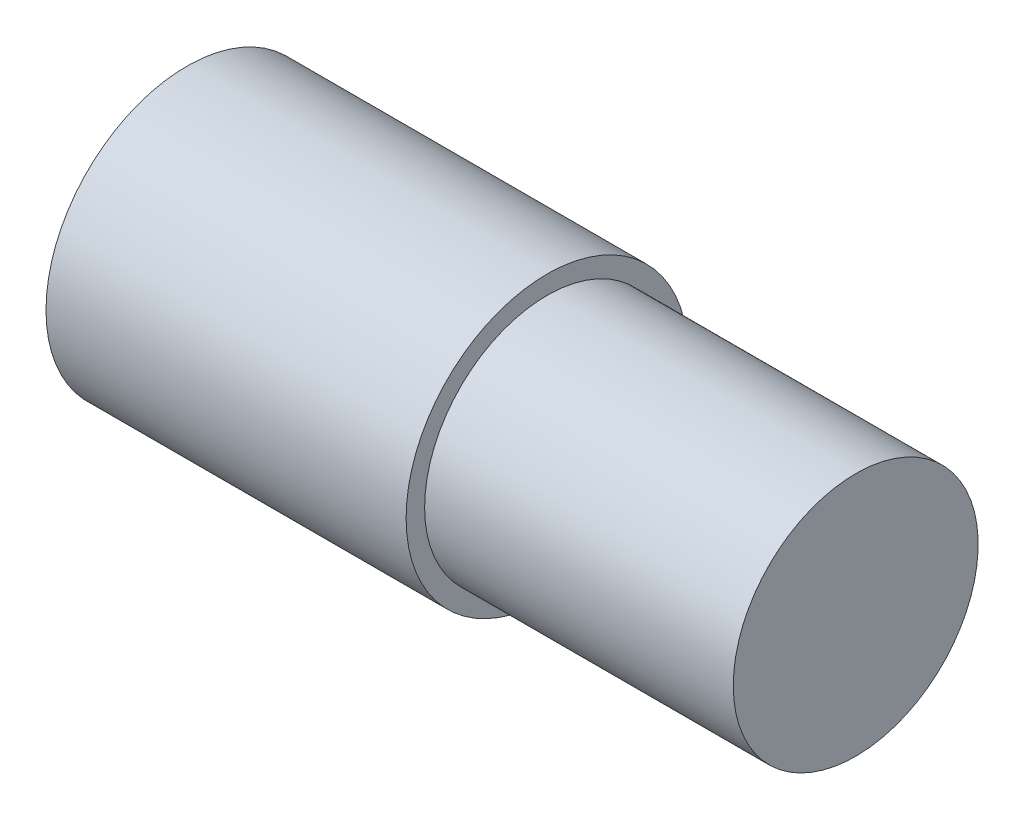
ISO-10303-21;
HEADER;
FILE_DESCRIPTION(('STEP AP214'),'2;1');
FILE_NAME('part.step','',(''),(''),'','','');
FILE_SCHEMA(('AUTOMOTIVE_DESIGN { 1 0 10303 214 1 1 1 1 }'));
ENDSEC;
DATA;
#1=APPLICATION_CONTEXT('core data for automotive mechanical design processes');
#2=APPLICATION_PROTOCOL_DEFINITION('international standard','automotive_design',2000,#1);
#3=PRODUCT_CONTEXT('',#1,'mechanical');
#4=PRODUCT('Part','Part','',(#3));
#5=PRODUCT_RELATED_PRODUCT_CATEGORY('part','',(#4));
#6=PRODUCT_DEFINITION_FORMATION('','',#4);
#7=PRODUCT_DEFINITION_CONTEXT('part definition',#1,'design');
#8=PRODUCT_DEFINITION('design','',#6,#7);
#9=PRODUCT_DEFINITION_SHAPE('','',#8);
#10=(LENGTH_UNIT() NAMED_UNIT(*) SI_UNIT(.MILLI.,.METRE.));
#11=(NAMED_UNIT(*) PLANE_ANGLE_UNIT() SI_UNIT($,.RADIAN.));
#12=(NAMED_UNIT(*) SI_UNIT($,.STERADIAN.) SOLID_ANGLE_UNIT());
#13=UNCERTAINTY_MEASURE_WITH_UNIT(LENGTH_MEASURE(1.E-05),#10,'distance_accuracy_value','');
#14=(GEOMETRIC_REPRESENTATION_CONTEXT(3) GLOBAL_UNCERTAINTY_ASSIGNED_CONTEXT((#13)) GLOBAL_UNIT_ASSIGNED_CONTEXT((#10,
#11,#12)) REPRESENTATION_CONTEXT('',''));
#15=CARTESIAN_POINT('',(0.,0.,0.));
#16=DIRECTION('',(0.,0.,1.));
#17=DIRECTION('',(1.,0.,0.));
#18=AXIS2_PLACEMENT_3D('',#15,#16,#17);
#19=CARTESIAN_POINT('',(0.,0.,0.));
#20=DIRECTION('',(1.,0.,0.));
#21=DIRECTION('',(0.,0.,-1.));
#22=AXIS2_PLACEMENT_3D('',#19,#20,#21);
#23=PLANE('',#22);
#24=CARTESIAN_POINT('',(0.,0.,0.));
#25=DIRECTION('',(-1.,0.,0.));
#26=DIRECTION('',(0.,0.,1.));
#27=AXIS2_PLACEMENT_3D('',#24,#25,#26);
#28=CIRCLE('',#27,17.399);
#29=CARTESIAN_POINT('',(0.,0.,17.399));
#30=VERTEX_POINT('',#29);
#31=EDGE_CURVE('E10',#30,#30,#28,.T.);
#32=ORIENTED_EDGE('',*,*,#31,.T.);
#33=EDGE_LOOP('',(#32));
#34=FACE_BOUND('',#33,.T.);
#35=ADVANCED_FACE('F31',(#34),#23,.F.);
#36=CARTESIAN_POINT('',(-28.9906800098856,0.,0.));
#37=DIRECTION('',(-1.,0.,0.));
#38=DIRECTION('',(0.,0.,1.));
#39=AXIS2_PLACEMENT_3D('',#36,#37,#38);
#40=CYLINDRICAL_SURFACE('',#39,17.399);
#41=ORIENTED_EDGE('',*,*,#31,.F.);
#42=EDGE_LOOP('',(#41));
#43=FACE_BOUND('',#42,.T.);
#44=CARTESIAN_POINT('',(44.45,0.,0.));
#45=DIRECTION('',(-1.,0.,0.));
#46=DIRECTION('',(0.,0.,1.));
#47=AXIS2_PLACEMENT_3D('',#44,#45,#46);
#48=CIRCLE('',#47,17.399);
#49=CARTESIAN_POINT('',(44.45,0.,17.399));
#50=VERTEX_POINT('',#49);
#51=EDGE_CURVE('E37',#50,#50,#48,.T.);
#52=ORIENTED_EDGE('',*,*,#51,.T.);
#53=EDGE_LOOP('',(#52));
#54=FACE_BOUND('',#53,.T.);
#55=ADVANCED_FACE('F63',(#43,#54),#40,.T.);
#56=CARTESIAN_POINT('',(44.45,17.399,0.));
#57=DIRECTION('',(-1.,0.,0.));
#58=DIRECTION('',(0.,0.,1.));
#59=AXIS2_PLACEMENT_3D('',#56,#57,#58);
#60=PLANE('',#59);
#61=ORIENTED_EDGE('',*,*,#51,.F.);
#62=EDGE_LOOP('',(#61));
#63=FACE_BOUND('',#62,.T.);
#64=CARTESIAN_POINT('',(44.45,0.,0.));
#65=DIRECTION('',(-1.,0.,0.));
#66=DIRECTION('',(0.,0.,1.));
#67=AXIS2_PLACEMENT_3D('',#64,#65,#66);
#68=CIRCLE('',#67,15.113);
#69=CARTESIAN_POINT('',(44.45,0.,15.113));
#70=VERTEX_POINT('',#69);
#71=EDGE_CURVE('E41',#70,#70,#68,.T.);
#72=ORIENTED_EDGE('',*,*,#71,.T.);
#73=EDGE_LOOP('',(#72));
#74=FACE_BOUND('',#73,.T.);
#75=ADVANCED_FACE('F59',(#63,#74),#60,.F.);
#76=CARTESIAN_POINT('',(-28.9906800098856,0.,0.));
#77=DIRECTION('',(-1.,0.,0.));
#78=DIRECTION('',(0.,0.,1.));
#79=AXIS2_PLACEMENT_3D('',#76,#77,#78);
#80=CYLINDRICAL_SURFACE('',#79,15.113);
#81=ORIENTED_EDGE('',*,*,#71,.F.);
#82=EDGE_LOOP('',(#81));
#83=FACE_BOUND('',#82,.T.);
#84=CARTESIAN_POINT('',(82.55,0.,0.));
#85=DIRECTION('',(-1.,0.,0.));
#86=DIRECTION('',(0.,0.,1.));
#87=AXIS2_PLACEMENT_3D('',#84,#85,#86);
#88=CIRCLE('',#87,15.113);
#89=CARTESIAN_POINT('',(82.55,0.,15.113));
#90=VERTEX_POINT('',#89);
#91=EDGE_CURVE('E45',#90,#90,#88,.T.);
#92=ORIENTED_EDGE('',*,*,#91,.T.);
#93=EDGE_LOOP('',(#92));
#94=FACE_BOUND('',#93,.T.);
#95=ADVANCED_FACE('F51',(#83,#94),#80,.T.);
#96=CARTESIAN_POINT('',(82.55,15.113,0.));
#97=DIRECTION('',(-1.,0.,0.));
#98=DIRECTION('',(0.,0.,1.));
#99=AXIS2_PLACEMENT_3D('',#96,#97,#98);
#100=PLANE('',#99);
#101=ORIENTED_EDGE('',*,*,#91,.F.);
#102=EDGE_LOOP('',(#101));
#103=FACE_BOUND('',#102,.T.);
#104=ADVANCED_FACE('F53',(#103),#100,.F.);
#105=CLOSED_SHELL('',(#35,#55,#75,#95,#104));
#106=MANIFOLD_SOLID_BREP('B2',#105);
#107=ADVANCED_BREP_SHAPE_REPRESENTATION('',(#18,#106),#14);
#108=SHAPE_DEFINITION_REPRESENTATION(#9,#107);
ENDSEC;
END-ISO-10303-21;
